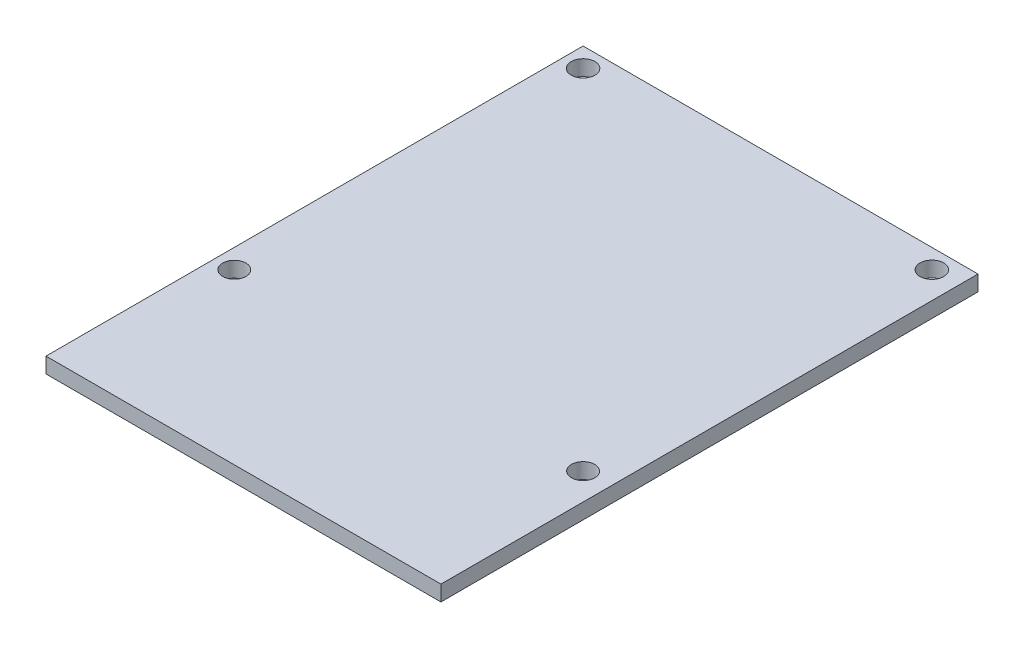
ISO-10303-21;
HEADER;
FILE_DESCRIPTION(('STEP AP214'),'2;1');
FILE_NAME('part.step','',(''),(''),'','','');
FILE_SCHEMA(('AUTOMOTIVE_DESIGN { 1 0 10303 214 1 1 1 1 }'));
ENDSEC;
DATA;
#1=APPLICATION_CONTEXT('core data for automotive mechanical design processes');
#2=APPLICATION_PROTOCOL_DEFINITION('international standard','automotive_design',2000,#1);
#3=PRODUCT_CONTEXT('',#1,'mechanical');
#4=PRODUCT('Part','Part','',(#3));
#5=PRODUCT_RELATED_PRODUCT_CATEGORY('part','',(#4));
#6=PRODUCT_DEFINITION_FORMATION('','',#4);
#7=PRODUCT_DEFINITION_CONTEXT('part definition',#1,'design');
#8=PRODUCT_DEFINITION('design','',#6,#7);
#9=PRODUCT_DEFINITION_SHAPE('','',#8);
#10=(LENGTH_UNIT() NAMED_UNIT(*) SI_UNIT(.MILLI.,.METRE.));
#11=(NAMED_UNIT(*) PLANE_ANGLE_UNIT() SI_UNIT($,.RADIAN.));
#12=(NAMED_UNIT(*) SI_UNIT($,.STERADIAN.) SOLID_ANGLE_UNIT());
#13=UNCERTAINTY_MEASURE_WITH_UNIT(LENGTH_MEASURE(1.E-05),#10,'distance_accuracy_value','');
#14=(GEOMETRIC_REPRESENTATION_CONTEXT(3) GLOBAL_UNCERTAINTY_ASSIGNED_CONTEXT((#13)) GLOBAL_UNIT_ASSIGNED_CONTEXT((#10,
#11,#12)) REPRESENTATION_CONTEXT('',''));
#15=CARTESIAN_POINT('',(0.,0.,0.));
#16=DIRECTION('',(0.,0.,1.));
#17=DIRECTION('',(1.,0.,0.));
#18=AXIS2_PLACEMENT_3D('',#15,#16,#17);
#19=CARTESIAN_POINT('',(0.,2.,0.));
#20=DIRECTION('',(0.,-1.,0.));
#21=DIRECTION('',(0.,0.,-1.));
#22=AXIS2_PLACEMENT_3D('',#19,#20,#21);
#23=PLANE('',#22);
#24=DIRECTION('',(0.,0.,-1.));
#25=VECTOR('',#24,1.);
#26=CARTESIAN_POINT('',(25.4765626477396,2.,34.6481252009259));
#27=LINE('',#26,#25);
#28=CARTESIAN_POINT('',(25.4765626477396,2.,34.6481252009259));
#29=VERTEX_POINT('',#28);
#30=CARTESIAN_POINT('',(25.4765626477396,2.,-34.6481252009259));
#31=VERTEX_POINT('',#30);
#32=EDGE_CURVE('E85',#29,#31,#27,.T.);
#33=ORIENTED_EDGE('',*,*,#32,.T.);
#34=DIRECTION('',(-1.,0.,0.));
#35=VECTOR('',#34,1.);
#36=CARTESIAN_POINT('',(-25.4765626477396,2.,-34.6481252009259));
#37=LINE('',#36,#35);
#38=CARTESIAN_POINT('',(-25.4765626477396,2.,-34.6481252009259));
#39=VERTEX_POINT('',#38);
#40=EDGE_CURVE('E80',#31,#39,#37,.T.);
#41=ORIENTED_EDGE('',*,*,#40,.T.);
#42=DIRECTION('',(0.,0.,1.));
#43=VECTOR('',#42,1.);
#44=CARTESIAN_POINT('',(-25.4765626477396,2.,34.6481252009259));
#45=LINE('',#44,#43);
#46=CARTESIAN_POINT('',(-25.4765626477396,2.,34.6481252009259));
#47=VERTEX_POINT('',#46);
#48=EDGE_CURVE('E83',#39,#47,#45,.T.);
#49=ORIENTED_EDGE('',*,*,#48,.T.);
#50=DIRECTION('',(1.,0.,0.));
#51=VECTOR('',#50,1.);
#52=CARTESIAN_POINT('',(-25.4765626477396,2.,34.6481252009259));
#53=LINE('',#52,#51);
#54=EDGE_CURVE('E50',#47,#29,#53,.T.);
#55=ORIENTED_EDGE('',*,*,#54,.T.);
#56=EDGE_LOOP('',(#33,#41,#49,#55));
#57=FACE_BOUND('',#56,.T.);
#58=CARTESIAN_POINT('',(-22.9765626477396,2.,-32.1481252009259));
#59=DIRECTION('',(0.,1.,0.));
#60=DIRECTION('',(0.,0.,1.));
#61=AXIS2_PLACEMENT_3D('',#58,#59,#60);
#62=CIRCLE('',#61,1.52859375886438);
#63=CARTESIAN_POINT('',(-22.9765626477396,2.,-30.6195314420615));
#64=VERTEX_POINT('',#63);
#65=EDGE_CURVE('E100',#64,#64,#62,.T.);
#66=ORIENTED_EDGE('',*,*,#65,.F.);
#67=EDGE_LOOP('',(#66));
#68=FACE_BOUND('',#67,.T.);
#69=CARTESIAN_POINT('',(22.0234373522604,2.,-32.1481252009259));
#70=DIRECTION('',(0.,1.,0.));
#71=DIRECTION('',(0.,0.,1.));
#72=AXIS2_PLACEMENT_3D('',#69,#70,#71);
#73=CIRCLE('',#72,1.52859375886438);
#74=CARTESIAN_POINT('',(22.0234373522604,2.,-30.6195314420615));
#75=VERTEX_POINT('',#74);
#76=EDGE_CURVE('E115',#75,#75,#73,.T.);
#77=ORIENTED_EDGE('',*,*,#76,.F.);
#78=EDGE_LOOP('',(#77));
#79=FACE_BOUND('',#78,.T.);
#80=CARTESIAN_POINT('',(22.0234373522604,2.,12.8518747990741));
#81=DIRECTION('',(0.,1.,0.));
#82=DIRECTION('',(0.,0.,1.));
#83=AXIS2_PLACEMENT_3D('',#80,#81,#82);
#84=CIRCLE('',#83,1.5);
#85=CARTESIAN_POINT('',(22.0234373522604,2.,14.3518747990741));
#86=VERTEX_POINT('',#85);
#87=EDGE_CURVE('E121',#86,#86,#84,.T.);
#88=ORIENTED_EDGE('',*,*,#87,.F.);
#89=EDGE_LOOP('',(#88));
#90=FACE_BOUND('',#89,.T.);
#91=CARTESIAN_POINT('',(-22.9765626477396,2.,12.8518747990741));
#92=DIRECTION('',(0.,1.,0.));
#93=DIRECTION('',(0.,0.,1.));
#94=AXIS2_PLACEMENT_3D('',#91,#92,#93);
#95=CIRCLE('',#94,1.5);
#96=CARTESIAN_POINT('',(-22.9765626477396,2.,14.3518747990741));
#97=VERTEX_POINT('',#96);
#98=EDGE_CURVE('E127',#97,#97,#95,.T.);
#99=ORIENTED_EDGE('',*,*,#98,.F.);
#100=EDGE_LOOP('',(#99));
#101=FACE_BOUND('',#100,.T.);
#102=ADVANCED_FACE('F33',(#57,#68,#79,#90,#101),#23,.F.);
#103=CARTESIAN_POINT('',(0.,0.,0.));
#104=DIRECTION('',(0.,-1.,0.));
#105=DIRECTION('',(0.,0.,-1.));
#106=AXIS2_PLACEMENT_3D('',#103,#104,#105);
#107=PLANE('',#106);
#108=CARTESIAN_POINT('',(22.0234373522604,0.,12.8518747990741));
#109=DIRECTION('',(0.,1.,0.));
#110=DIRECTION('',(0.,0.,1.));
#111=AXIS2_PLACEMENT_3D('',#108,#109,#110);
#112=CIRCLE('',#111,1.5);
#113=CARTESIAN_POINT('',(22.0234373522604,0.,14.3518747990741));
#114=VERTEX_POINT('',#113);
#115=EDGE_CURVE('E124',#114,#114,#112,.T.);
#116=ORIENTED_EDGE('',*,*,#115,.T.);
#117=EDGE_LOOP('',(#116));
#118=FACE_BOUND('',#117,.T.);
#119=CARTESIAN_POINT('',(-22.9765626477396,0.,-32.1481252009259));
#120=DIRECTION('',(0.,1.,0.));
#121=DIRECTION('',(0.,0.,1.));
#122=AXIS2_PLACEMENT_3D('',#119,#120,#121);
#123=CIRCLE('',#122,1.52859375886438);
#124=CARTESIAN_POINT('',(-22.9765626477396,0.,-30.6195314420615));
#125=VERTEX_POINT('',#124);
#126=EDGE_CURVE('E112',#125,#125,#123,.T.);
#127=ORIENTED_EDGE('',*,*,#126,.T.);
#128=EDGE_LOOP('',(#127));
#129=FACE_BOUND('',#128,.T.);
#130=DIRECTION('',(0.,0.,-1.));
#131=VECTOR('',#130,1.);
#132=CARTESIAN_POINT('',(25.4765626477396,0.,34.6481252009259));
#133=LINE('',#132,#131);
#134=CARTESIAN_POINT('',(25.4765626477396,0.,34.6481252009259));
#135=VERTEX_POINT('',#134);
#136=CARTESIAN_POINT('',(25.4765626477396,0.,-34.6481252009259));
#137=VERTEX_POINT('',#136);
#138=EDGE_CURVE('E97',#135,#137,#133,.T.);
#139=ORIENTED_EDGE('',*,*,#138,.F.);
#140=DIRECTION('',(1.,0.,0.));
#141=VECTOR('',#140,1.);
#142=CARTESIAN_POINT('',(-25.4765626477396,0.,34.6481252009259));
#143=LINE('',#142,#141);
#144=CARTESIAN_POINT('',(-25.4765626477396,0.,34.6481252009259));
#145=VERTEX_POINT('',#144);
#146=EDGE_CURVE('E73',#145,#135,#143,.T.);
#147=ORIENTED_EDGE('',*,*,#146,.F.);
#148=DIRECTION('',(0.,0.,1.));
#149=VECTOR('',#148,1.);
#150=CARTESIAN_POINT('',(-25.4765626477396,0.,34.6481252009259));
#151=LINE('',#150,#149);
#152=CARTESIAN_POINT('',(-25.4765626477396,0.,-34.6481252009259));
#153=VERTEX_POINT('',#152);
#154=EDGE_CURVE('E67',#153,#145,#151,.T.);
#155=ORIENTED_EDGE('',*,*,#154,.F.);
#156=DIRECTION('',(-1.,0.,0.));
#157=VECTOR('',#156,1.);
#158=CARTESIAN_POINT('',(-25.4765626477396,0.,-34.6481252009259));
#159=LINE('',#158,#157);
#160=EDGE_CURVE('E89',#137,#153,#159,.T.);
#161=ORIENTED_EDGE('',*,*,#160,.F.);
#162=EDGE_LOOP('',(#139,#147,#155,#161));
#163=FACE_BOUND('',#162,.T.);
#164=CARTESIAN_POINT('',(22.0234373522604,0.,-32.1481252009259));
#165=DIRECTION('',(0.,1.,0.));
#166=DIRECTION('',(0.,0.,1.));
#167=AXIS2_PLACEMENT_3D('',#164,#165,#166);
#168=CIRCLE('',#167,1.52859375886438);
#169=CARTESIAN_POINT('',(22.0234373522604,0.,-30.6195314420615));
#170=VERTEX_POINT('',#169);
#171=EDGE_CURVE('E118',#170,#170,#168,.T.);
#172=ORIENTED_EDGE('',*,*,#171,.T.);
#173=EDGE_LOOP('',(#172));
#174=FACE_BOUND('',#173,.T.);
#175=CARTESIAN_POINT('',(-22.9765626477396,0.,12.8518747990741));
#176=DIRECTION('',(0.,1.,0.));
#177=DIRECTION('',(0.,0.,1.));
#178=AXIS2_PLACEMENT_3D('',#175,#176,#177);
#179=CIRCLE('',#178,1.5);
#180=CARTESIAN_POINT('',(-22.9765626477396,0.,14.3518747990741));
#181=VERTEX_POINT('',#180);
#182=EDGE_CURVE('E130',#181,#181,#179,.T.);
#183=ORIENTED_EDGE('',*,*,#182,.T.);
#184=EDGE_LOOP('',(#183));
#185=FACE_BOUND('',#184,.T.);
#186=ADVANCED_FACE('F108',(#118,#129,#163,#174,#185),#107,.T.);
#187=CARTESIAN_POINT('',(25.4765626477396,2.,34.6481252009259));
#188=DIRECTION('',(-1.,0.,0.));
#189=DIRECTION('',(0.,0.,1.));
#190=AXIS2_PLACEMENT_3D('',#187,#188,#189);
#191=PLANE('',#190);
#192=ORIENTED_EDGE('',*,*,#138,.T.);
#193=DIRECTION('',(0.,-1.,0.));
#194=VECTOR('',#193,1.);
#195=CARTESIAN_POINT('',(25.4765626477396,2.,-34.6481252009259));
#196=LINE('',#195,#194);
#197=EDGE_CURVE('E11',#31,#137,#196,.T.);
#198=ORIENTED_EDGE('',*,*,#197,.F.);
#199=ORIENTED_EDGE('',*,*,#32,.F.);
#200=DIRECTION('',(0.,-1.,0.));
#201=VECTOR('',#200,1.);
#202=CARTESIAN_POINT('',(25.4765626477396,2.,34.6481252009259));
#203=LINE('',#202,#201);
#204=EDGE_CURVE('E93',#29,#135,#203,.T.);
#205=ORIENTED_EDGE('',*,*,#204,.T.);
#206=EDGE_LOOP('',(#192,#198,#199,#205));
#207=FACE_BOUND('',#206,.T.);
#208=ADVANCED_FACE('F35',(#207),#191,.F.);
#209=CARTESIAN_POINT('',(-25.4765626477396,2.,-34.6481252009259));
#210=DIRECTION('',(0.,0.,1.));
#211=DIRECTION('',(1.,0.,0.));
#212=AXIS2_PLACEMENT_3D('',#209,#210,#211);
#213=PLANE('',#212);
#214=ORIENTED_EDGE('',*,*,#160,.T.);
#215=DIRECTION('',(0.,-1.,0.));
#216=VECTOR('',#215,1.);
#217=CARTESIAN_POINT('',(-25.4765626477396,2.,-34.6481252009259));
#218=LINE('',#217,#216);
#219=EDGE_CURVE('E42',#39,#153,#218,.T.);
#220=ORIENTED_EDGE('',*,*,#219,.F.);
#221=ORIENTED_EDGE('',*,*,#40,.F.);
#222=ORIENTED_EDGE('',*,*,#197,.T.);
#223=EDGE_LOOP('',(#214,#220,#221,#222));
#224=FACE_BOUND('',#223,.T.);
#225=ADVANCED_FACE('F88',(#224),#213,.F.);
#226=CARTESIAN_POINT('',(-25.4765626477396,2.,34.6481252009259));
#227=DIRECTION('',(1.,0.,0.));
#228=DIRECTION('',(0.,0.,-1.));
#229=AXIS2_PLACEMENT_3D('',#226,#227,#228);
#230=PLANE('',#229);
#231=ORIENTED_EDGE('',*,*,#154,.T.);
#232=DIRECTION('',(0.,-1.,0.));
#233=VECTOR('',#232,1.);
#234=CARTESIAN_POINT('',(-25.4765626477396,2.,34.6481252009259));
#235=LINE('',#234,#233);
#236=EDGE_CURVE('E90',#47,#145,#235,.T.);
#237=ORIENTED_EDGE('',*,*,#236,.F.);
#238=ORIENTED_EDGE('',*,*,#48,.F.);
#239=ORIENTED_EDGE('',*,*,#219,.T.);
#240=EDGE_LOOP('',(#231,#237,#238,#239));
#241=FACE_BOUND('',#240,.T.);
#242=ADVANCED_FACE('F91',(#241),#230,.F.);
#243=CARTESIAN_POINT('',(-25.4765626477396,2.,34.6481252009259));
#244=DIRECTION('',(0.,0.,-1.));
#245=DIRECTION('',(-1.,0.,0.));
#246=AXIS2_PLACEMENT_3D('',#243,#244,#245);
#247=PLANE('',#246);
#248=ORIENTED_EDGE('',*,*,#146,.T.);
#249=ORIENTED_EDGE('',*,*,#204,.F.);
#250=ORIENTED_EDGE('',*,*,#54,.F.);
#251=ORIENTED_EDGE('',*,*,#236,.T.);
#252=EDGE_LOOP('',(#248,#249,#250,#251));
#253=FACE_BOUND('',#252,.T.);
#254=ADVANCED_FACE('F105',(#253),#247,.F.);
#255=CARTESIAN_POINT('',(-22.9765626477396,2.,-32.1481252009259));
#256=DIRECTION('',(0.,-1.,0.));
#257=DIRECTION('',(0.,0.,-1.));
#258=AXIS2_PLACEMENT_3D('',#255,#256,#257);
#259=CYLINDRICAL_SURFACE('',#258,1.52859375886438);
#260=ORIENTED_EDGE('',*,*,#65,.T.);
#261=EDGE_LOOP('',(#260));
#262=FACE_BOUND('',#261,.T.);
#263=ORIENTED_EDGE('',*,*,#126,.F.);
#264=EDGE_LOOP('',(#263));
#265=FACE_BOUND('',#264,.T.);
#266=ADVANCED_FACE('F147',(#262,#265),#259,.F.);
#267=CARTESIAN_POINT('',(22.0234373522604,2.,-32.1481252009259));
#268=DIRECTION('',(0.,-1.,0.));
#269=DIRECTION('',(0.,0.,-1.));
#270=AXIS2_PLACEMENT_3D('',#267,#268,#269);
#271=CYLINDRICAL_SURFACE('',#270,1.52859375886438);
#272=ORIENTED_EDGE('',*,*,#76,.T.);
#273=EDGE_LOOP('',(#272));
#274=FACE_BOUND('',#273,.T.);
#275=ORIENTED_EDGE('',*,*,#171,.F.);
#276=EDGE_LOOP('',(#275));
#277=FACE_BOUND('',#276,.T.);
#278=ADVANCED_FACE('F193',(#274,#277),#271,.F.);
#279=CARTESIAN_POINT('',(22.0234373522604,2.,12.8518747990741));
#280=DIRECTION('',(0.,-1.,0.));
#281=DIRECTION('',(0.,0.,-1.));
#282=AXIS2_PLACEMENT_3D('',#279,#280,#281);
#283=CYLINDRICAL_SURFACE('',#282,1.5);
#284=ORIENTED_EDGE('',*,*,#87,.T.);
#285=EDGE_LOOP('',(#284));
#286=FACE_BOUND('',#285,.T.);
#287=ORIENTED_EDGE('',*,*,#115,.F.);
#288=EDGE_LOOP('',(#287));
#289=FACE_BOUND('',#288,.T.);
#290=ADVANCED_FACE('F201',(#286,#289),#283,.F.);
#291=CARTESIAN_POINT('',(-22.9765626477396,2.,12.8518747990741));
#292=DIRECTION('',(0.,-1.,0.));
#293=DIRECTION('',(0.,0.,-1.));
#294=AXIS2_PLACEMENT_3D('',#291,#292,#293);
#295=CYLINDRICAL_SURFACE('',#294,1.5);
#296=ORIENTED_EDGE('',*,*,#98,.T.);
#297=EDGE_LOOP('',(#296));
#298=FACE_BOUND('',#297,.T.);
#299=ORIENTED_EDGE('',*,*,#182,.F.);
#300=EDGE_LOOP('',(#299));
#301=FACE_BOUND('',#300,.T.);
#302=ADVANCED_FACE('F136',(#298,#301),#295,.F.);
#303=CLOSED_SHELL('',(#102,#186,#208,#225,#242,#254,#266,#278,#290,#302));
#304=MANIFOLD_SOLID_BREP('B2',#303);
#305=ADVANCED_BREP_SHAPE_REPRESENTATION('',(#18,#304),#14);
#306=SHAPE_DEFINITION_REPRESENTATION(#9,#305);
ENDSEC;
END-ISO-10303-21;
